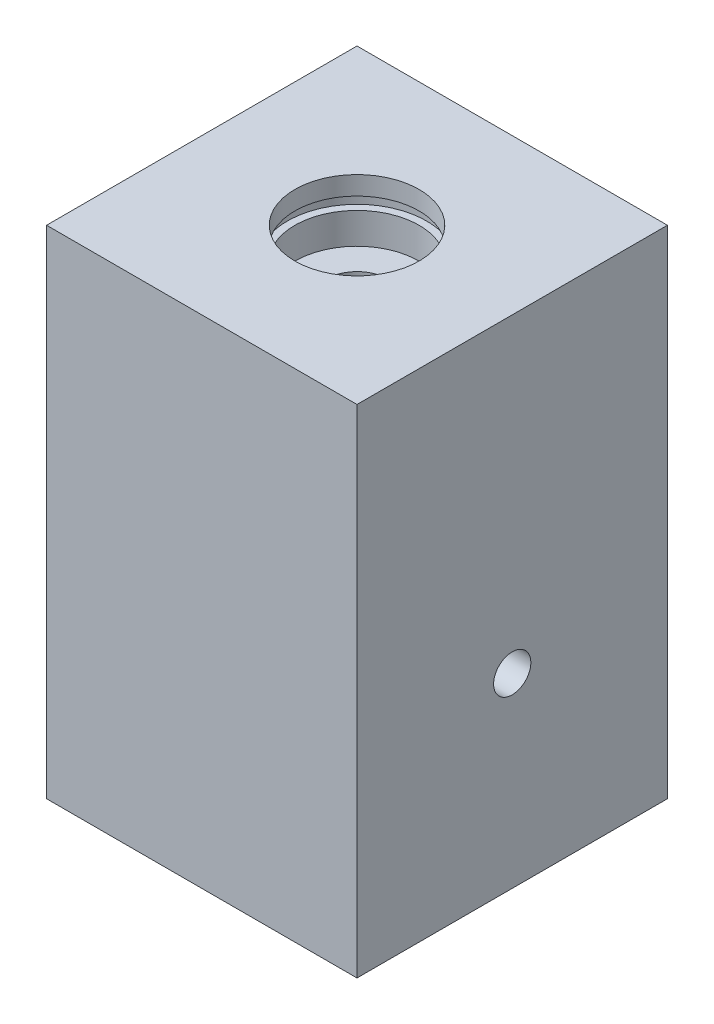
ISO-10303-21;
HEADER;
FILE_DESCRIPTION(('STEP AP214'),'2;1');
FILE_NAME('part.step','',(''),(''),'','','');
FILE_SCHEMA(('AUTOMOTIVE_DESIGN { 1 0 10303 214 1 1 1 1 }'));
ENDSEC;
DATA;
#1=APPLICATION_CONTEXT('core data for automotive mechanical design processes');
#2=APPLICATION_PROTOCOL_DEFINITION('international standard','automotive_design',2000,#1);
#3=PRODUCT_CONTEXT('',#1,'mechanical');
#4=PRODUCT('Part','Part','',(#3));
#5=PRODUCT_RELATED_PRODUCT_CATEGORY('part','',(#4));
#6=PRODUCT_DEFINITION_FORMATION('','',#4);
#7=PRODUCT_DEFINITION_CONTEXT('part definition',#1,'design');
#8=PRODUCT_DEFINITION('design','',#6,#7);
#9=PRODUCT_DEFINITION_SHAPE('','',#8);
#10=(LENGTH_UNIT() NAMED_UNIT(*) SI_UNIT(.MILLI.,.METRE.));
#11=(NAMED_UNIT(*) PLANE_ANGLE_UNIT() SI_UNIT($,.RADIAN.));
#12=(NAMED_UNIT(*) SI_UNIT($,.STERADIAN.) SOLID_ANGLE_UNIT());
#13=UNCERTAINTY_MEASURE_WITH_UNIT(LENGTH_MEASURE(1.E-05),#10,'distance_accuracy_value','');
#14=(GEOMETRIC_REPRESENTATION_CONTEXT(3) GLOBAL_UNCERTAINTY_ASSIGNED_CONTEXT((#13)) GLOBAL_UNIT_ASSIGNED_CONTEXT((#10,
#11,#12)) REPRESENTATION_CONTEXT('',''));
#15=CARTESIAN_POINT('',(0.,0.,0.));
#16=DIRECTION('',(0.,0.,1.));
#17=DIRECTION('',(1.,0.,0.));
#18=AXIS2_PLACEMENT_3D('',#15,#16,#17);
#19=CARTESIAN_POINT('',(25.,50.,25.));
#20=DIRECTION('',(0.,0.,-1.));
#21=DIRECTION('',(0.,1.,0.));
#22=AXIS2_PLACEMENT_3D('',#19,#20,#21);
#23=PLANE('',#22);
#24=DIRECTION('',(0.,-1.,0.));
#25=VECTOR('',#24,1.);
#26=CARTESIAN_POINT('',(-25.,50.,25.));
#27=LINE('',#26,#25);
#28=CARTESIAN_POINT('',(-25.,50.,25.));
#29=VERTEX_POINT('',#28);
#30=CARTESIAN_POINT('',(-25.,-30.,25.));
#31=VERTEX_POINT('',#30);
#32=EDGE_CURVE('E122',#29,#31,#27,.T.);
#33=ORIENTED_EDGE('',*,*,#32,.T.);
#34=DIRECTION('',(-1.,0.,0.));
#35=VECTOR('',#34,1.);
#36=CARTESIAN_POINT('',(25.,-30.,25.));
#37=LINE('',#36,#35);
#38=CARTESIAN_POINT('',(25.,-30.,25.));
#39=VERTEX_POINT('',#38);
#40=EDGE_CURVE('E11',#39,#31,#37,.T.);
#41=ORIENTED_EDGE('',*,*,#40,.F.);
#42=DIRECTION('',(0.,-1.,0.));
#43=VECTOR('',#42,1.);
#44=CARTESIAN_POINT('',(25.,50.,25.));
#45=LINE('',#44,#43);
#46=CARTESIAN_POINT('',(25.,50.,25.));
#47=VERTEX_POINT('',#46);
#48=EDGE_CURVE('E137',#47,#39,#45,.T.);
#49=ORIENTED_EDGE('',*,*,#48,.F.);
#50=DIRECTION('',(-1.,0.,0.));
#51=VECTOR('',#50,1.);
#52=CARTESIAN_POINT('',(25.,50.,25.));
#53=LINE('',#52,#51);
#54=EDGE_CURVE('E124',#47,#29,#53,.T.);
#55=ORIENTED_EDGE('',*,*,#54,.T.);
#56=EDGE_LOOP('',(#33,#41,#49,#55));
#57=FACE_BOUND('',#56,.T.);
#58=ADVANCED_FACE('F37',(#57),#23,.F.);
#59=CARTESIAN_POINT('',(25.,-30.,25.));
#60=DIRECTION('',(0.,1.,0.));
#61=DIRECTION('',(0.,0.,1.));
#62=AXIS2_PLACEMENT_3D('',#59,#60,#61);
#63=PLANE('',#62);
#64=DIRECTION('',(0.,0.,-1.));
#65=VECTOR('',#64,1.);
#66=CARTESIAN_POINT('',(-25.,-30.,25.));
#67=LINE('',#66,#65);
#68=CARTESIAN_POINT('',(-25.,-30.,-25.));
#69=VERTEX_POINT('',#68);
#70=EDGE_CURVE('E126',#31,#69,#67,.T.);
#71=ORIENTED_EDGE('',*,*,#70,.T.);
#72=DIRECTION('',(-1.,0.,0.));
#73=VECTOR('',#72,1.);
#74=CARTESIAN_POINT('',(25.,-30.,-25.));
#75=LINE('',#74,#73);
#76=CARTESIAN_POINT('',(25.,-30.,-25.));
#77=VERTEX_POINT('',#76);
#78=EDGE_CURVE('E51',#77,#69,#75,.T.);
#79=ORIENTED_EDGE('',*,*,#78,.F.);
#80=DIRECTION('',(0.,0.,-1.));
#81=VECTOR('',#80,1.);
#82=CARTESIAN_POINT('',(25.,-30.,25.));
#83=LINE('',#82,#81);
#84=EDGE_CURVE('E91',#39,#77,#83,.T.);
#85=ORIENTED_EDGE('',*,*,#84,.F.);
#86=ORIENTED_EDGE('',*,*,#40,.T.);
#87=EDGE_LOOP('',(#71,#79,#85,#86));
#88=FACE_BOUND('',#87,.T.);
#89=ADVANCED_FACE('F113',(#88),#63,.F.);
#90=CARTESIAN_POINT('',(25.,50.,-25.));
#91=DIRECTION('',(0.,0.,1.));
#92=DIRECTION('',(0.,-1.,0.));
#93=AXIS2_PLACEMENT_3D('',#90,#91,#92);
#94=PLANE('',#93);
#95=DIRECTION('',(0.,1.,0.));
#96=VECTOR('',#95,1.);
#97=CARTESIAN_POINT('',(-25.,50.,-25.));
#98=LINE('',#97,#96);
#99=CARTESIAN_POINT('',(-25.,50.,-25.));
#100=VERTEX_POINT('',#99);
#101=EDGE_CURVE('E78',#69,#100,#98,.T.);
#102=ORIENTED_EDGE('',*,*,#101,.T.);
#103=DIRECTION('',(-1.,0.,0.));
#104=VECTOR('',#103,1.);
#105=CARTESIAN_POINT('',(25.,50.,-25.));
#106=LINE('',#105,#104);
#107=CARTESIAN_POINT('',(25.,50.,-25.));
#108=VERTEX_POINT('',#107);
#109=EDGE_CURVE('E139',#108,#100,#106,.T.);
#110=ORIENTED_EDGE('',*,*,#109,.F.);
#111=DIRECTION('',(0.,1.,0.));
#112=VECTOR('',#111,1.);
#113=CARTESIAN_POINT('',(25.,50.,-25.));
#114=LINE('',#113,#112);
#115=EDGE_CURVE('E192',#77,#108,#114,.T.);
#116=ORIENTED_EDGE('',*,*,#115,.F.);
#117=ORIENTED_EDGE('',*,*,#78,.T.);
#118=EDGE_LOOP('',(#102,#110,#116,#117));
#119=FACE_BOUND('',#118,.T.);
#120=ADVANCED_FACE('F118',(#119),#94,.F.);
#121=CARTESIAN_POINT('',(25.,50.,25.));
#122=DIRECTION('',(0.,-1.,0.));
#123=DIRECTION('',(0.,0.,-1.));
#124=AXIS2_PLACEMENT_3D('',#121,#122,#123);
#125=PLANE('',#124);
#126=CARTESIAN_POINT('',(0.,50.,0.));
#127=DIRECTION('',(0.,1.,0.));
#128=DIRECTION('',(0.,0.,1.));
#129=AXIS2_PLACEMENT_3D('',#126,#127,#128);
#130=CIRCLE('',#129,10.);
#131=CARTESIAN_POINT('',(0.,50.,10.));
#132=VERTEX_POINT('',#131);
#133=EDGE_CURVE('E206',#132,#132,#130,.T.);
#134=ORIENTED_EDGE('',*,*,#133,.F.);
#135=EDGE_LOOP('',(#134));
#136=FACE_BOUND('',#135,.T.);
#137=DIRECTION('',(0.,0.,1.));
#138=VECTOR('',#137,1.);
#139=CARTESIAN_POINT('',(-25.,50.,25.));
#140=LINE('',#139,#138);
#141=EDGE_CURVE('E84',#100,#29,#140,.T.);
#142=ORIENTED_EDGE('',*,*,#141,.T.);
#143=ORIENTED_EDGE('',*,*,#54,.F.);
#144=DIRECTION('',(0.,0.,1.));
#145=VECTOR('',#144,1.);
#146=CARTESIAN_POINT('',(25.,50.,25.));
#147=LINE('',#146,#145);
#148=EDGE_CURVE('E60',#108,#47,#147,.T.);
#149=ORIENTED_EDGE('',*,*,#148,.F.);
#150=ORIENTED_EDGE('',*,*,#109,.T.);
#151=EDGE_LOOP('',(#142,#143,#149,#150));
#152=FACE_BOUND('',#151,.T.);
#153=ADVANCED_FACE('F194',(#136,#152),#125,.F.);
#154=CARTESIAN_POINT('',(25.,0.,0.));
#155=DIRECTION('',(1.,0.,0.));
#156=DIRECTION('',(0.,0.,-1.));
#157=AXIS2_PLACEMENT_3D('',#154,#155,#156);
#158=PLANE('',#157);
#159=CARTESIAN_POINT('',(25.,0.,0.));
#160=DIRECTION('',(1.,0.,0.));
#161=DIRECTION('',(0.,0.,-1.));
#162=AXIS2_PLACEMENT_3D('',#159,#160,#161);
#163=CIRCLE('',#162,3.);
#164=CARTESIAN_POINT('',(25.,0.,-3.));
#165=VERTEX_POINT('',#164);
#166=EDGE_CURVE('E229',#165,#165,#163,.T.);
#167=ORIENTED_EDGE('',*,*,#166,.F.);
#168=EDGE_LOOP('',(#167));
#169=FACE_BOUND('',#168,.T.);
#170=ORIENTED_EDGE('',*,*,#48,.T.);
#171=ORIENTED_EDGE('',*,*,#84,.T.);
#172=ORIENTED_EDGE('',*,*,#115,.T.);
#173=ORIENTED_EDGE('',*,*,#148,.T.);
#174=EDGE_LOOP('',(#170,#171,#172,#173));
#175=FACE_BOUND('',#174,.T.);
#176=ADVANCED_FACE('F107',(#169,#175),#158,.T.);
#177=CARTESIAN_POINT('',(-25.,0.,0.));
#178=DIRECTION('',(1.,0.,0.));
#179=DIRECTION('',(0.,0.,-1.));
#180=AXIS2_PLACEMENT_3D('',#177,#178,#179);
#181=PLANE('',#180);
#182=CARTESIAN_POINT('',(-25.,0.,0.));
#183=DIRECTION('',(1.,0.,0.));
#184=DIRECTION('',(0.,0.,-1.));
#185=AXIS2_PLACEMENT_3D('',#182,#183,#184);
#186=CIRCLE('',#185,2.99999999999999);
#187=CARTESIAN_POINT('',(-25.,0.,-2.99999999999999));
#188=VERTEX_POINT('',#187);
#189=EDGE_CURVE('E146',#188,#188,#186,.T.);
#190=ORIENTED_EDGE('',*,*,#189,.T.);
#191=EDGE_LOOP('',(#190));
#192=FACE_BOUND('',#191,.T.);
#193=ORIENTED_EDGE('',*,*,#32,.F.);
#194=ORIENTED_EDGE('',*,*,#141,.F.);
#195=ORIENTED_EDGE('',*,*,#101,.F.);
#196=ORIENTED_EDGE('',*,*,#70,.F.);
#197=EDGE_LOOP('',(#193,#194,#195,#196));
#198=FACE_BOUND('',#197,.T.);
#199=ADVANCED_FACE('F98',(#192,#198),#181,.F.);
#200=CARTESIAN_POINT('',(0.,-23.0043030951378,0.));
#201=DIRECTION('',(0.,1.,0.));
#202=DIRECTION('',(0.,0.,1.));
#203=AXIS2_PLACEMENT_3D('',#200,#201,#202);
#204=CONICAL_SURFACE('',#203,0.,1.02974425867665);
#205=CARTESIAN_POINT('',(0.,-20.,0.));
#206=DIRECTION('',(0.,1.,0.));
#207=DIRECTION('',(0.,0.,1.));
#208=AXIS2_PLACEMENT_3D('',#205,#206,#207);
#209=CIRCLE('',#208,4.99999999999999);
#210=CARTESIAN_POINT('',(0.,-20.,4.99999999999998));
#211=VERTEX_POINT('',#210);
#212=EDGE_CURVE('E127',#211,#211,#209,.T.);
#213=ORIENTED_EDGE('',*,*,#212,.T.);
#214=EDGE_LOOP('',(#213));
#215=FACE_BOUND('',#214,.T.);
#216=CARTESIAN_POINT('',(0.,-23.0043030951378,0.));
#217=VERTEX_POINT('',#216);
#218=VERTEX_LOOP('',#217);
#219=FACE_BOUND('',#218,.T.);
#220=ADVANCED_FACE('F95',(#215,#219),#204,.F.);
#221=CARTESIAN_POINT('',(0.,-23.0043030951378,0.));
#222=DIRECTION('',(0.,1.,0.));
#223=DIRECTION('',(0.,0.,1.));
#224=AXIS2_PLACEMENT_3D('',#221,#222,#223);
#225=CYLINDRICAL_SURFACE('',#224,5.);
#226=CARTESIAN_POINT('',(-4.00000000000001,0.,-3.));
#227=CARTESIAN_POINT('',(-3.99999997094659,0.0754616103656618,-2.99999990599239));
#228=CARTESIAN_POINT('',(-4.00214560778387,0.150919951825706,-2.99714660074499));
#229=CARTESIAN_POINT('',(-4.0106190584126,0.301183579155877,-2.98579602023829));
#230=CARTESIAN_POINT('',(-4.01694847458098,0.37598860368072,-2.97729658251828));
#231=CARTESIAN_POINT('',(-4.04185988554314,0.598542400800125,-2.94350195877));
#232=CARTESIAN_POINT('',(-4.06636523363868,0.744466163038648,-2.90991036792576));
#233=CARTESIAN_POINT('',(-4.1272446631328,1.02619529387302,-2.82286888064331));
#234=CARTESIAN_POINT('',(-4.16353284212728,1.16206540972156,-2.76956233581238));
#235=CARTESIAN_POINT('',(-4.24371857831164,1.42286717142596,-2.645058939393));
#236=CARTESIAN_POINT('',(-4.28761840405595,1.54779553947815,-2.5738567513836));
#237=CARTESIAN_POINT('',(-4.38457211439751,1.79990131024536,-2.40542341931061));
#238=CARTESIAN_POINT('',(-4.43808896832274,1.92548608074574,-2.30607419983945));
#239=CARTESIAN_POINT('',(-4.54452303763809,2.15952535636891,-2.08854542159202));
#240=CARTESIAN_POINT('',(-4.59743977155759,2.26796690142325,-1.97035175093534));
#241=CARTESIAN_POINT('',(-4.70351798165429,2.47628246871424,-1.70284578042266));
#242=CARTESIAN_POINT('',(-4.75608869625049,2.57396641364106,-1.55155129309905));
#243=CARTESIAN_POINT('',(-4.82570563669469,2.69974650858797,-1.31132430439156));
#244=CARTESIAN_POINT('',(-4.84737661360987,2.73822411545811,-1.22900736782604));
#245=CARTESIAN_POINT('',(-4.88701002756049,2.80779096487914,-1.06047221299631));
#246=CARTESIAN_POINT('',(-4.90497491519086,2.83888509171157,-0.974256618946842));
#247=CARTESIAN_POINT('',(-4.9351119388654,2.89062746245329,-0.806968026671433));
#248=CARTESIAN_POINT('',(-4.94767216447126,2.9119872715291,-0.726184158740185));
#249=CARTESIAN_POINT('',(-4.96892323787742,2.94794996135095,-0.562666348744428));
#250=CARTESIAN_POINT('',(-4.97761624192487,2.9625566076376,-0.479933520527562));
#251=CARTESIAN_POINT('',(-4.99087754875312,2.98478468451609,-0.313244621267392));
#252=CARTESIAN_POINT('',(-4.99544805239181,2.9924098423118,-0.229289227265365));
#253=CARTESIAN_POINT('',(-5.00033941607428,3.00056663984717,-0.0609397888852041));
#254=CARTESIAN_POINT('',(-5.00066070848408,3.00109900129356,0.0234542099897606));
#255=CARTESIAN_POINT('',(-4.99565270087357,2.99275721772025,0.255171183646358));
#256=CARTESIAN_POINT('',(-4.98590479614142,2.97652885035085,0.40221995726717));
#257=CARTESIAN_POINT('',(-4.95416390550291,2.92304450631758,0.690956248818426));
#258=CARTESIAN_POINT('',(-4.9321700133334,2.88578697338949,0.832643369131344));
#259=CARTESIAN_POINT('',(-4.87769707511975,2.79166776699804,1.10810607069191));
#260=CARTESIAN_POINT('',(-4.84515792140775,2.73469357980007,1.2418309672266));
#261=CARTESIAN_POINT('',(-4.77219304045846,2.6032310655483,1.49797933560354));
#262=CARTESIAN_POINT('',(-4.73176526544935,2.52873818986414,1.62039986081242));
#263=CARTESIAN_POINT('',(-4.64075842839173,2.35432172038148,1.86614789799246));
#264=CARTESIAN_POINT('',(-4.58954363323803,2.25242335146449,1.98783715480756));
#265=CARTESIAN_POINT('',(-4.48511110796775,2.03119178989514,2.2134294892317));
#266=CARTESIAN_POINT('',(-4.43189074054161,1.91183500028094,2.31730807434112));
#267=CARTESIAN_POINT('',(-4.32222149525339,1.64269317960225,2.51649670159325));
#268=CARTESIAN_POINT('',(-4.26611322583747,1.4909848446704,2.60941864927586));
#269=CARTESIAN_POINT('',(-4.16501759300692,1.17058753897333,2.76794435835451));
#270=CARTESIAN_POINT('',(-4.12000980621703,1.00193056868575,2.83359844351372));
#271=CARTESIAN_POINT('',(-4.05791730375361,0.695212735504368,2.92154993808435));
#272=CARTESIAN_POINT('',(-4.03667777278559,0.559918734207664,2.95055806318484));
#273=CARTESIAN_POINT('',(-4.00784301513238,0.285252780598734,2.98961745817055));
#274=CARTESIAN_POINT('',(-4.00023192044756,0.145885763115491,2.99969077510549));
#275=CARTESIAN_POINT('',(-3.9997782882838,-0.133103368961639,3.00029561322377));
#276=CARTESIAN_POINT('',(-4.00695621149424,-0.272725569601721,2.99080006076192));
#277=CARTESIAN_POINT('',(-4.03503040875294,-0.547974672313773,2.95280584471632));
#278=CARTESIAN_POINT('',(-4.05593752603304,-0.683598327819909,2.92429216045109));
#279=CARTESIAN_POINT('',(-4.10863539286051,-0.947429215549479,2.84976612867927));
#280=CARTESIAN_POINT('',(-4.14041253958233,-1.07564548413755,2.8037756438149));
#281=CARTESIAN_POINT('',(-4.21143069058874,-1.32295522030752,2.69592568264801));
#282=CARTESIAN_POINT('',(-4.25067450889246,-1.4420452245939,2.63406022035171));
#283=CARTESIAN_POINT('',(-4.34073681424694,-1.69048109524631,2.48334675803861));
#284=CARTESIAN_POINT('',(-4.39236652981539,-1.81780543232944,2.391645038527));
#285=CARTESIAN_POINT('',(-4.49643335252964,-2.05656720394541,2.18975614095891));
#286=CARTESIAN_POINT('',(-4.54887118822613,-2.16798924609444,2.07955127457131));
#287=CARTESIAN_POINT('',(-4.65671991538655,-2.38646399131575,1.82651475528322));
#288=CARTESIAN_POINT('',(-4.71163080343122,-2.49106470576289,1.68130397020028));
#289=CARTESIAN_POINT('',(-4.78599458202112,-2.62815449772339,1.44944631278511));
#290=CARTESIAN_POINT('',(-4.80945640676867,-2.67056200213691,1.36978605711653));
#291=CARTESIAN_POINT('',(-4.85305400686527,-2.74830388347849,1.20623656162324));
#292=CARTESIAN_POINT('',(-4.87319187464059,-2.7836427131187,1.12235002598574));
#293=CARTESIAN_POINT('',(-4.90820667253681,-2.84447964323442,0.957140698774934));
#294=CARTESIAN_POINT('',(-4.92335831278731,-2.87050371846179,0.876069467337982));
#295=CARTESIAN_POINT('',(-4.94982497459132,-2.91566498160908,0.711460619981302));
#296=CARTESIAN_POINT('',(-4.96114214594589,-2.93480602887991,0.62792441470883));
#297=CARTESIAN_POINT('',(-4.9795990393125,-2.96590030971309,0.459119615082279));
#298=CARTESIAN_POINT('',(-4.98674160560363,-2.97785843736055,0.373852241304044));
#299=CARTESIAN_POINT('',(-4.99664216975595,-2.99440676165901,0.202384159163472));
#300=CARTESIAN_POINT('',(-4.99940073918633,-2.99899791878895,0.116183573945416));
#301=CARTESIAN_POINT('',(-5.00079353601933,-3.0013282897594,-0.119519384080583));
#302=CARTESIAN_POINT('',(-4.99493619757571,-2.9916010745741,-0.269213134971589));
#303=CARTESIAN_POINT('',(-4.97026391444784,-2.95021794585105,-0.564325544477559));
#304=CARTESIAN_POINT('',(-4.95144882543497,-2.91856178805991,-0.709744155455483));
#305=CARTESIAN_POINT('',(-4.90298726022977,-2.83555942935371,-0.990283617430278));
#306=CARTESIAN_POINT('',(-4.87351900635897,-2.784536560451,-1.12553205648681));
#307=CARTESIAN_POINT('',(-4.8060670798365,-2.66471905823651,-1.38556595318152));
#308=CARTESIAN_POINT('',(-4.76808149787885,-2.59592043965643,-1.51034905620296));
#309=CARTESIAN_POINT('',(-4.68186861678972,-2.43415009310424,-1.76052652812015));
#310=CARTESIAN_POINT('',(-4.63297714592577,-2.33936493647195,-1.88451663454097));
#311=CARTESIAN_POINT('',(-4.5320378935883,-2.1324915754345,-2.11579577789689));
#312=CARTESIAN_POINT('',(-4.47998665474643,-2.0203842023356,-2.22306604531463));
#313=CARTESIAN_POINT('',(-4.37056449731608,-1.76543895662125,-2.43181699852643));
#314=CARTESIAN_POINT('',(-4.31335603990194,-1.6205069155109,-2.53083841179814));
#315=CARTESIAN_POINT('',(-4.20752457767503,-1.31299042740473,-2.70314606061125));
#316=CARTESIAN_POINT('',(-4.15889711577767,-1.15041521580196,-2.77644567607668));
#317=CARTESIAN_POINT('',(-4.10004730463766,-0.903377447312362,-2.86193484914579));
#318=CARTESIAN_POINT('',(-4.08329508678221,-0.82434140870277,-2.88571236613332));
#319=CARTESIAN_POINT('',(-4.0539508765597,-0.663869558199833,-2.92679381745551));
#320=CARTESIAN_POINT('',(-4.04135625254713,-0.582435300012676,-2.94410184772356));
#321=CARTESIAN_POINT('',(-4.02094972226271,-0.417953449305943,-2.97191221271433));
#322=CARTESIAN_POINT('',(-4.0131302337705,-0.334908631628278,-2.98242533831513));
#323=CARTESIAN_POINT('',(-4.00265571377827,-0.167907783336387,-2.99646884485438));
#324=CARTESIAN_POINT('',(-4.00000003232226,-0.0839518687375946,-3.00000010458448));
#325=CARTESIAN_POINT('',(-4.00000000000001,0.,-3.));
#326=B_SPLINE_CURVE_WITH_KNOTS('',3,(#226,#227,#228,#229,#230,#231,#232,#233,#234,#235,#236,
#237,#238,#239,#240,#241,#242,#243,#244,#245,#246,#247,#248,#249,#250,#251,#252,#253,#254,#255,
#256,#257,#258,#259,#260,#261,#262,#263,#264,#265,#266,#267,#268,#269,#270,#271,#272,#273,#274,
#275,#276,#277,#278,#279,#280,#281,#282,#283,#284,#285,#286,#287,#288,#289,#290,#291,#292,#293,
#294,#295,#296,#297,#298,#299,#300,#301,#302,#303,#304,#305,#306,#307,#308,#309,#310,#311,#312,
#313,#314,#315,#316,#317,#318,#319,#320,#321,#322,#323,#324,#325),.UNSPECIFIED.,.T.,.F.,(4,2,2,
2,2,2,2,2,2,2,2,2,2,2,2,2,2,2,2,2,2,2,2,2,2,2,2,2,2,2,2,2,2,2,2,2,2,2,2,2,2,2,2,2,2,2,2,2,2,4),
(0.,0.226288173517879,0.452663065091107,0.905305714765856,1.35471981612576,1.804268090599,
2.30878181396805,2.81367513819685,3.37309572088443,3.65297634398311,3.93267130287329,
4.18580566749443,4.43879871451845,4.6916566173785,4.94448879122708,5.38694235003538,
5.82942865693064,6.27448283989928,6.71965270654931,7.21799594026828,7.71701907227942,
8.27387316194678,8.82969494223661,9.24786570023493,9.66554925202078,10.0838110593649,
10.5024036052238,10.9204742264512,11.3387027222345,11.8323285087813,12.3264288987103,
12.884776299373,13.1641700331408,13.4433872125907,13.7024631857776,13.9613936663242,
14.2201475237758,14.4788676430947,14.9267946196281,15.3747265854331,15.8154875864152,
16.2563474905318,16.7450674536299,17.2343321574792,17.7856420979722,18.3366648323362,
18.5890061072371,18.8411873492278,19.0929671157917,19.3447151893881),.UNSPECIFIED.);
#327=CARTESIAN_POINT('',(-4.00000000000001,0.,-3.));
#328=VERTEX_POINT('',#327);
#329=EDGE_CURVE('E40',#328,#328,#326,.T.);
#330=ORIENTED_EDGE('',*,*,#329,.F.);
#331=EDGE_LOOP('',(#330));
#332=FACE_BOUND('',#331,.T.);
#333=CARTESIAN_POINT('',(4.00000000000001,0.,-3.));
#334=CARTESIAN_POINT('',(3.99999997094659,-0.0754616103656618,-2.99999990599239));
#335=CARTESIAN_POINT('',(4.00214560778387,-0.150919951825706,-2.99714660074499));
#336=CARTESIAN_POINT('',(4.0106190584126,-0.301183579155877,-2.98579602023829));
#337=CARTESIAN_POINT('',(4.01694847458098,-0.37598860368072,-2.97729658251828));
#338=CARTESIAN_POINT('',(4.04185988554314,-0.598542400800125,-2.94350195877));
#339=CARTESIAN_POINT('',(4.06636523363868,-0.744466163038648,-2.90991036792576));
#340=CARTESIAN_POINT('',(4.1272446631328,-1.02619529387302,-2.82286888064331));
#341=CARTESIAN_POINT('',(4.16353284212728,-1.16206540972156,-2.76956233581238));
#342=CARTESIAN_POINT('',(4.24371857831164,-1.42286717142596,-2.645058939393));
#343=CARTESIAN_POINT('',(4.28761840405595,-1.54779553947816,-2.5738567513836));
#344=CARTESIAN_POINT('',(4.38457211439751,-1.79990131024536,-2.40542341931061));
#345=CARTESIAN_POINT('',(4.43808896832274,-1.92548608074574,-2.30607419983945));
#346=CARTESIAN_POINT('',(4.54452303763809,-2.15952535636891,-2.08854542159202));
#347=CARTESIAN_POINT('',(4.59743977155759,-2.26796690142325,-1.97035175093533));
#348=CARTESIAN_POINT('',(4.70351798165429,-2.47628246871424,-1.70284578042266));
#349=CARTESIAN_POINT('',(4.75608869625049,-2.57396641364106,-1.55155129309905));
#350=CARTESIAN_POINT('',(4.82570563669469,-2.69974650858797,-1.31132430439156));
#351=CARTESIAN_POINT('',(4.84737661360987,-2.73822411545811,-1.22900736782604));
#352=CARTESIAN_POINT('',(4.88701002756049,-2.80779096487914,-1.06047221299631));
#353=CARTESIAN_POINT('',(4.90497491519086,-2.83888509171157,-0.974256618946841));
#354=CARTESIAN_POINT('',(4.9351119388654,-2.89062746245329,-0.806968026671433));
#355=CARTESIAN_POINT('',(4.94767216447126,-2.9119872715291,-0.726184158740184));
#356=CARTESIAN_POINT('',(4.96892323787742,-2.94794996135095,-0.562666348744428));
#357=CARTESIAN_POINT('',(4.97761624192487,-2.9625566076376,-0.479933520527561));
#358=CARTESIAN_POINT('',(4.99087754875312,-2.98478468451609,-0.313244621267392));
#359=CARTESIAN_POINT('',(4.99544805239181,-2.9924098423118,-0.229289227265364));
#360=CARTESIAN_POINT('',(5.00033941607428,-3.00056663984717,-0.0609397888852036));
#361=CARTESIAN_POINT('',(5.00066070848408,-3.00109900129356,0.0234542099897608));
#362=CARTESIAN_POINT('',(4.99565270087357,-2.99275721772025,0.255171183646359));
#363=CARTESIAN_POINT('',(4.98590479614142,-2.97652885035085,0.40221995726717));
#364=CARTESIAN_POINT('',(4.95416390550291,-2.92304450631758,0.690956248818426));
#365=CARTESIAN_POINT('',(4.9321700133334,-2.88578697338949,0.832643369131344));
#366=CARTESIAN_POINT('',(4.87769707511975,-2.79166776699804,1.10810607069191));
#367=CARTESIAN_POINT('',(4.84515792140775,-2.73469357980007,1.2418309672266));
#368=CARTESIAN_POINT('',(4.77219304045846,-2.6032310655483,1.49797933560354));
#369=CARTESIAN_POINT('',(4.73176526544935,-2.52873818986414,1.62039986081242));
#370=CARTESIAN_POINT('',(4.64075842839173,-2.35432172038148,1.86614789799246));
#371=CARTESIAN_POINT('',(4.58954363323803,-2.25242335146449,1.98783715480756));
#372=CARTESIAN_POINT('',(4.48511110796775,-2.03119178989514,2.2134294892317));
#373=CARTESIAN_POINT('',(4.43189074054161,-1.91183500028094,2.31730807434112));
#374=CARTESIAN_POINT('',(4.32222149525339,-1.64269317960225,2.51649670159325));
#375=CARTESIAN_POINT('',(4.26611322583747,-1.4909848446704,2.60941864927586));
#376=CARTESIAN_POINT('',(4.16501759300692,-1.17058753897333,2.76794435835451));
#377=CARTESIAN_POINT('',(4.12000980621703,-1.00193056868575,2.83359844351372));
#378=CARTESIAN_POINT('',(4.05791730375361,-0.695212735504369,2.92154993808435));
#379=CARTESIAN_POINT('',(4.03667777278559,-0.559918734207665,2.95055806318484));
#380=CARTESIAN_POINT('',(4.00784301513238,-0.285252780598736,2.98961745817055));
#381=CARTESIAN_POINT('',(4.00023192044756,-0.145885763115492,2.99969077510549));
#382=CARTESIAN_POINT('',(3.9997782882838,0.133103368961638,3.00029561322377));
#383=CARTESIAN_POINT('',(4.00695621149424,0.272725569601719,2.99080006076192));
#384=CARTESIAN_POINT('',(4.03503040875294,0.547974672313772,2.95280584471632));
#385=CARTESIAN_POINT('',(4.05593752603305,0.683598327819908,2.92429216045109));
#386=CARTESIAN_POINT('',(4.10863539286051,0.947429215549478,2.84976612867927));
#387=CARTESIAN_POINT('',(4.14041253958233,1.07564548413755,2.8037756438149));
#388=CARTESIAN_POINT('',(4.21143069058874,1.32295522030752,2.69592568264801));
#389=CARTESIAN_POINT('',(4.25067450889246,1.4420452245939,2.63406022035171));
#390=CARTESIAN_POINT('',(4.34073681424694,1.69048109524631,2.48334675803861));
#391=CARTESIAN_POINT('',(4.39236652981539,1.81780543232944,2.39164503852699));
#392=CARTESIAN_POINT('',(4.49643335252964,2.05656720394541,2.18975614095891));
#393=CARTESIAN_POINT('',(4.54887118822613,2.16798924609444,2.07955127457131));
#394=CARTESIAN_POINT('',(4.65671991538655,2.38646399131575,1.82651475528322));
#395=CARTESIAN_POINT('',(4.71163080343122,2.49106470576289,1.68130397020028));
#396=CARTESIAN_POINT('',(4.78599458202112,2.62815449772339,1.44944631278511));
#397=CARTESIAN_POINT('',(4.80945640676867,2.67056200213691,1.36978605711653));
#398=CARTESIAN_POINT('',(4.85305400686527,2.74830388347849,1.20623656162324));
#399=CARTESIAN_POINT('',(4.87319187464059,2.7836427131187,1.12235002598574));
#400=CARTESIAN_POINT('',(4.90820667253681,2.84447964323442,0.957140698774933));
#401=CARTESIAN_POINT('',(4.92335831278731,2.87050371846179,0.876069467337982));
#402=CARTESIAN_POINT('',(4.94982497459132,2.91566498160908,0.711460619981301));
#403=CARTESIAN_POINT('',(4.96114214594589,2.93480602887991,0.627924414708829));
#404=CARTESIAN_POINT('',(4.9795990393125,2.96590030971309,0.459119615082276));
#405=CARTESIAN_POINT('',(4.98674160560363,2.97785843736055,0.373852241304042));
#406=CARTESIAN_POINT('',(4.99664216975595,2.99440676165901,0.20238415916347));
#407=CARTESIAN_POINT('',(4.99940073918633,2.99899791878895,0.116183573945414));
#408=CARTESIAN_POINT('',(5.00079353601933,3.0013282897594,-0.119519384080584));
#409=CARTESIAN_POINT('',(4.99493619757571,2.9916010745741,-0.269213134971589));
#410=CARTESIAN_POINT('',(4.97026391444784,2.95021794585105,-0.564325544477559));
#411=CARTESIAN_POINT('',(4.95144882543497,2.91856178805991,-0.709744155455483));
#412=CARTESIAN_POINT('',(4.90298726022977,2.83555942935371,-0.990283617430279));
#413=CARTESIAN_POINT('',(4.87351900635897,2.784536560451,-1.12553205648681));
#414=CARTESIAN_POINT('',(4.8060670798365,2.66471905823651,-1.38556595318152));
#415=CARTESIAN_POINT('',(4.76808149787885,2.59592043965643,-1.51034905620296));
#416=CARTESIAN_POINT('',(4.68186861678972,2.43415009310424,-1.76052652812015));
#417=CARTESIAN_POINT('',(4.63297714592577,2.33936493647195,-1.88451663454097));
#418=CARTESIAN_POINT('',(4.5320378935883,2.1324915754345,-2.11579577789689));
#419=CARTESIAN_POINT('',(4.47998665474643,2.0203842023356,-2.22306604531463));
#420=CARTESIAN_POINT('',(4.37056449731608,1.76543895662125,-2.43181699852643));
#421=CARTESIAN_POINT('',(4.31335603990194,1.6205069155109,-2.53083841179814));
#422=CARTESIAN_POINT('',(4.20752457767503,1.31299042740473,-2.70314606061125));
#423=CARTESIAN_POINT('',(4.15889711577767,1.15041521580196,-2.77644567607668));
#424=CARTESIAN_POINT('',(4.10004730463766,0.903377447312361,-2.86193484914579));
#425=CARTESIAN_POINT('',(4.08329508678221,0.82434140870277,-2.88571236613332));
#426=CARTESIAN_POINT('',(4.0539508765597,0.663869558199833,-2.92679381745551));
#427=CARTESIAN_POINT('',(4.04135625254713,0.582435300012676,-2.94410184772356));
#428=CARTESIAN_POINT('',(4.02094972226271,0.417953449305942,-2.97191221271433));
#429=CARTESIAN_POINT('',(4.0131302337705,0.334908631628276,-2.98242533831513));
#430=CARTESIAN_POINT('',(4.00265571377827,0.167907783336384,-2.99646884485438));
#431=CARTESIAN_POINT('',(4.00000003232226,0.0839518687375933,-3.00000010458448));
#432=CARTESIAN_POINT('',(4.00000000000001,0.,-3.));
#433=B_SPLINE_CURVE_WITH_KNOTS('',3,(#333,#334,#335,#336,#337,#338,#339,#340,#341,#342,#343,
#344,#345,#346,#347,#348,#349,#350,#351,#352,#353,#354,#355,#356,#357,#358,#359,#360,#361,#362,
#363,#364,#365,#366,#367,#368,#369,#370,#371,#372,#373,#374,#375,#376,#377,#378,#379,#380,#381,
#382,#383,#384,#385,#386,#387,#388,#389,#390,#391,#392,#393,#394,#395,#396,#397,#398,#399,#400,
#401,#402,#403,#404,#405,#406,#407,#408,#409,#410,#411,#412,#413,#414,#415,#416,#417,#418,#419,
#420,#421,#422,#423,#424,#425,#426,#427,#428,#429,#430,#431,#432),.UNSPECIFIED.,.T.,.F.,(4,2,2,
2,2,2,2,2,2,2,2,2,2,2,2,2,2,2,2,2,2,2,2,2,2,2,2,2,2,2,2,2,2,2,2,2,2,2,2,2,2,2,2,2,2,2,2,2,2,4),
(0.,0.226288173517879,0.452663065091107,0.905305714765856,1.35471981612576,1.804268090599,
2.30878181396805,2.81367513819685,3.37309572088443,3.65297634398311,3.93267130287329,
4.18580566749444,4.43879871451845,4.6916566173785,4.94448879122708,5.38694235003538,
5.82942865693064,6.27448283989928,6.71965270654931,7.21799594026828,7.71701907227942,
8.27387316194678,8.82969494223661,9.24786570023493,9.66554925202078,10.0838110593649,
10.5024036052238,10.9204742264511,11.3387027222345,11.8323285087813,12.3264288987103,
12.884776299373,13.1641700331408,13.4433872125907,13.7024631857776,13.9613936663243,
14.2201475237758,14.4788676430947,14.9267946196281,15.3747265854331,15.8154875864153,
16.2563474905318,16.7450674536299,17.2343321574792,17.7856420979722,18.3366648323362,
18.5890061072371,18.8411873492278,19.0929671157917,19.3447151893881),.UNSPECIFIED.);
#434=CARTESIAN_POINT('',(4.00000000000001,0.,-3.));
#435=VERTEX_POINT('',#434);
#436=EDGE_CURVE('E141',#435,#435,#433,.T.);
#437=ORIENTED_EDGE('',*,*,#436,.F.);
#438=EDGE_LOOP('',(#437));
#439=FACE_BOUND('',#438,.T.);
#440=CARTESIAN_POINT('',(0.,40.,0.));
#441=DIRECTION('',(0.,1.,0.));
#442=DIRECTION('',(0.,0.,1.));
#443=AXIS2_PLACEMENT_3D('',#440,#441,#442);
#444=CIRCLE('',#443,5.00000000000001);
#445=CARTESIAN_POINT('',(0.,40.,5.00000000000002));
#446=VERTEX_POINT('',#445);
#447=EDGE_CURVE('E130',#446,#446,#444,.T.);
#448=ORIENTED_EDGE('',*,*,#447,.T.);
#449=EDGE_LOOP('',(#448));
#450=FACE_BOUND('',#449,.T.);
#451=ORIENTED_EDGE('',*,*,#212,.F.);
#452=EDGE_LOOP('',(#451));
#453=FACE_BOUND('',#452,.T.);
#454=ADVANCED_FACE('F97',(#332,#439,#450,#453),#225,.F.);
#455=CARTESIAN_POINT('',(0.,40.,-5.00000000000001));
#456=DIRECTION('',(0.,1.,0.));
#457=DIRECTION('',(0.,0.,1.));
#458=AXIS2_PLACEMENT_3D('',#455,#456,#457);
#459=PLANE('',#458);
#460=CARTESIAN_POINT('',(0.,40.,0.));
#461=DIRECTION('',(0.,1.,0.));
#462=DIRECTION('',(0.,0.,1.));
#463=AXIS2_PLACEMENT_3D('',#460,#461,#462);
#464=CIRCLE('',#463,10.);
#465=CARTESIAN_POINT('',(0.,40.,10.));
#466=VERTEX_POINT('',#465);
#467=EDGE_CURVE('E182',#466,#466,#464,.T.);
#468=ORIENTED_EDGE('',*,*,#467,.T.);
#469=EDGE_LOOP('',(#468));
#470=FACE_BOUND('',#469,.T.);
#471=ORIENTED_EDGE('',*,*,#447,.F.);
#472=EDGE_LOOP('',(#471));
#473=FACE_BOUND('',#472,.T.);
#474=ADVANCED_FACE('F105',(#470,#473),#459,.T.);
#475=CARTESIAN_POINT('',(0.,-23.0043030951378,0.));
#476=DIRECTION('',(0.,1.,0.));
#477=DIRECTION('',(0.,0.,1.));
#478=AXIS2_PLACEMENT_3D('',#475,#476,#477);
#479=CYLINDRICAL_SURFACE('',#478,10.);
#480=CARTESIAN_POINT('',(0.,45.,0.));
#481=DIRECTION('',(0.,1.,0.));
#482=DIRECTION('',(0.,0.,1.));
#483=AXIS2_PLACEMENT_3D('',#480,#481,#482);
#484=CIRCLE('',#483,10.);
#485=CARTESIAN_POINT('',(0.,45.,10.));
#486=VERTEX_POINT('',#485);
#487=EDGE_CURVE('E187',#486,#486,#484,.T.);
#488=ORIENTED_EDGE('',*,*,#487,.T.);
#489=EDGE_LOOP('',(#488));
#490=FACE_BOUND('',#489,.T.);
#491=ORIENTED_EDGE('',*,*,#467,.F.);
#492=EDGE_LOOP('',(#491));
#493=FACE_BOUND('',#492,.T.);
#494=ADVANCED_FACE('F171',(#490,#493),#479,.F.);
#495=CARTESIAN_POINT('',(0.,45.,-11.2));
#496=DIRECTION('',(0.,1.,0.));
#497=DIRECTION('',(0.,0.,1.));
#498=AXIS2_PLACEMENT_3D('',#495,#496,#497);
#499=PLANE('',#498);
#500=CARTESIAN_POINT('',(0.,45.,0.));
#501=DIRECTION('',(0.,1.,0.));
#502=DIRECTION('',(0.,0.,1.));
#503=AXIS2_PLACEMENT_3D('',#500,#501,#502);
#504=CIRCLE('',#503,11.2);
#505=CARTESIAN_POINT('',(0.,45.,11.2));
#506=VERTEX_POINT('',#505);
#507=EDGE_CURVE('E218',#506,#506,#504,.T.);
#508=ORIENTED_EDGE('',*,*,#507,.T.);
#509=EDGE_LOOP('',(#508));
#510=FACE_BOUND('',#509,.T.);
#511=ORIENTED_EDGE('',*,*,#487,.F.);
#512=EDGE_LOOP('',(#511));
#513=FACE_BOUND('',#512,.T.);
#514=ADVANCED_FACE('F167',(#510,#513),#499,.T.);
#515=CARTESIAN_POINT('',(0.,-23.0043030951378,0.));
#516=DIRECTION('',(0.,1.,0.));
#517=DIRECTION('',(0.,0.,1.));
#518=AXIS2_PLACEMENT_3D('',#515,#516,#517);
#519=CYLINDRICAL_SURFACE('',#518,11.2);
#520=CARTESIAN_POINT('',(0.,47.,0.));
#521=DIRECTION('',(0.,1.,0.));
#522=DIRECTION('',(0.,0.,1.));
#523=AXIS2_PLACEMENT_3D('',#520,#521,#522);
#524=CIRCLE('',#523,11.2);
#525=CARTESIAN_POINT('',(0.,47.,11.2));
#526=VERTEX_POINT('',#525);
#527=EDGE_CURVE('E210',#526,#526,#524,.T.);
#528=ORIENTED_EDGE('',*,*,#527,.T.);
#529=EDGE_LOOP('',(#528));
#530=FACE_BOUND('',#529,.T.);
#531=ORIENTED_EDGE('',*,*,#507,.F.);
#532=EDGE_LOOP('',(#531));
#533=FACE_BOUND('',#532,.T.);
#534=ADVANCED_FACE('F163',(#530,#533),#519,.F.);
#535=CARTESIAN_POINT('',(0.,47.,-10.));
#536=DIRECTION('',(0.,-1.,0.));
#537=DIRECTION('',(0.,0.,-1.));
#538=AXIS2_PLACEMENT_3D('',#535,#536,#537);
#539=PLANE('',#538);
#540=CARTESIAN_POINT('',(0.,47.,0.));
#541=DIRECTION('',(0.,1.,0.));
#542=DIRECTION('',(0.,0.,1.));
#543=AXIS2_PLACEMENT_3D('',#540,#541,#542);
#544=CIRCLE('',#543,10.);
#545=CARTESIAN_POINT('',(0.,47.,10.));
#546=VERTEX_POINT('',#545);
#547=EDGE_CURVE('E207',#546,#546,#544,.T.);
#548=ORIENTED_EDGE('',*,*,#547,.T.);
#549=EDGE_LOOP('',(#548));
#550=FACE_BOUND('',#549,.T.);
#551=ORIENTED_EDGE('',*,*,#527,.F.);
#552=EDGE_LOOP('',(#551));
#553=FACE_BOUND('',#552,.T.);
#554=ADVANCED_FACE('F159',(#550,#553),#539,.T.);
#555=CARTESIAN_POINT('',(0.,-23.0043030951378,0.));
#556=DIRECTION('',(0.,1.,0.));
#557=DIRECTION('',(0.,0.,1.));
#558=AXIS2_PLACEMENT_3D('',#555,#556,#557);
#559=CYLINDRICAL_SURFACE('',#558,10.);
#560=ORIENTED_EDGE('',*,*,#133,.T.);
#561=EDGE_LOOP('',(#560));
#562=FACE_BOUND('',#561,.T.);
#563=ORIENTED_EDGE('',*,*,#547,.F.);
#564=EDGE_LOOP('',(#563));
#565=FACE_BOUND('',#564,.T.);
#566=ADVANCED_FACE('F154',(#562,#565),#559,.F.);
#567=CARTESIAN_POINT('',(25.,0.,0.));
#568=DIRECTION('',(1.,0.,0.));
#569=DIRECTION('',(0.,0.,-1.));
#570=AXIS2_PLACEMENT_3D('',#567,#568,#569);
#571=CYLINDRICAL_SURFACE('',#570,3.);
#572=ORIENTED_EDGE('',*,*,#436,.T.);
#573=EDGE_LOOP('',(#572));
#574=FACE_BOUND('',#573,.T.);
#575=ORIENTED_EDGE('',*,*,#166,.T.);
#576=EDGE_LOOP('',(#575));
#577=FACE_BOUND('',#576,.T.);
#578=ADVANCED_FACE('F149',(#574,#577),#571,.F.);
#579=ORIENTED_EDGE('',*,*,#329,.T.);
#580=EDGE_LOOP('',(#579));
#581=FACE_BOUND('',#580,.T.);
#582=ORIENTED_EDGE('',*,*,#189,.F.);
#583=EDGE_LOOP('',(#582));
#584=FACE_BOUND('',#583,.T.);
#585=ADVANCED_FACE('F153',(#581,#584),#571,.F.);
#586=CLOSED_SHELL('',(#58,#89,#120,#153,#176,#199,#220,#454,#474,#494,#514,#534,#554,#566,#578,#585));
#587=MANIFOLD_SOLID_BREP('B2',#586);
#588=ADVANCED_BREP_SHAPE_REPRESENTATION('',(#18,#587),#14);
#589=SHAPE_DEFINITION_REPRESENTATION(#9,#588);
ENDSEC;
END-ISO-10303-21;
